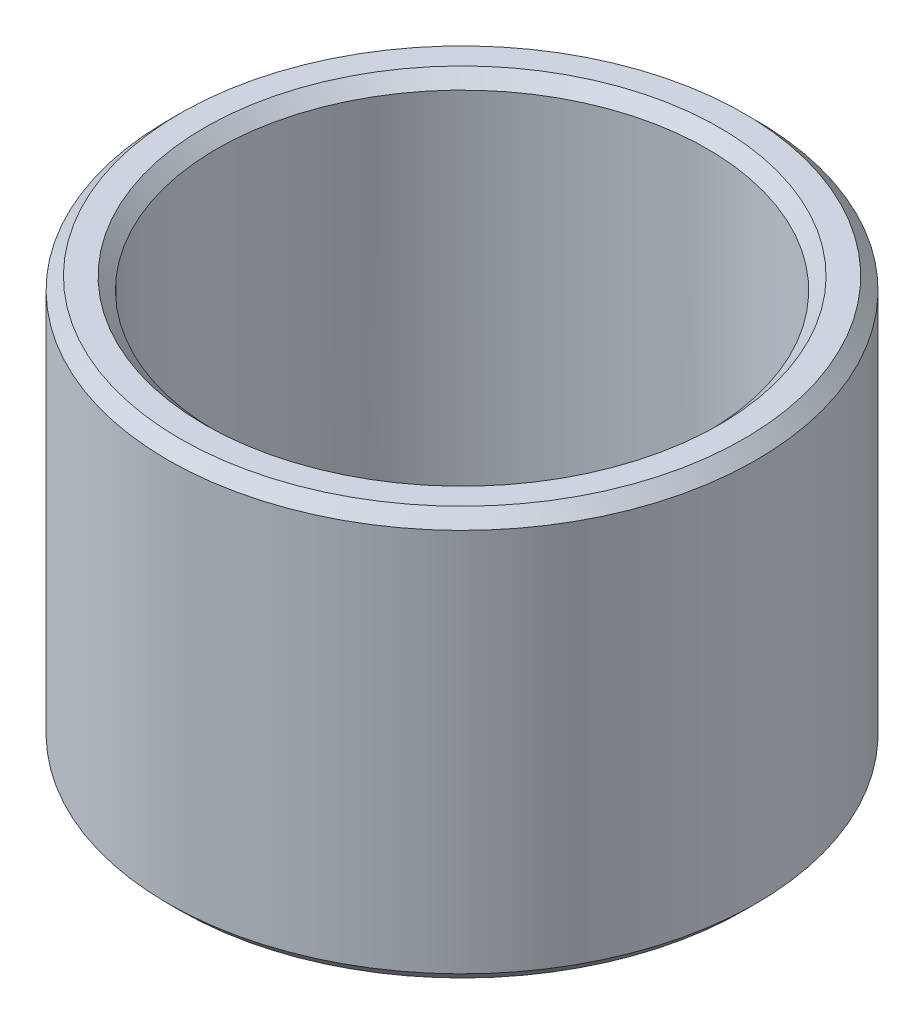
ISO-10303-21;
HEADER;
FILE_DESCRIPTION(('STEP AP214'),'2;1');
FILE_NAME('part.step','',(''),(''),'','','');
FILE_SCHEMA(('AUTOMOTIVE_DESIGN { 1 0 10303 214 1 1 1 1 }'));
ENDSEC;
DATA;
#1=APPLICATION_CONTEXT('core data for automotive mechanical design processes');
#2=APPLICATION_PROTOCOL_DEFINITION('international standard','automotive_design',2000,#1);
#3=PRODUCT_CONTEXT('',#1,'mechanical');
#4=PRODUCT('Part','Part','',(#3));
#5=PRODUCT_RELATED_PRODUCT_CATEGORY('part','',(#4));
#6=PRODUCT_DEFINITION_FORMATION('','',#4);
#7=PRODUCT_DEFINITION_CONTEXT('part definition',#1,'design');
#8=PRODUCT_DEFINITION('design','',#6,#7);
#9=PRODUCT_DEFINITION_SHAPE('','',#8);
#10=(LENGTH_UNIT() NAMED_UNIT(*) SI_UNIT(.MILLI.,.METRE.));
#11=(NAMED_UNIT(*) PLANE_ANGLE_UNIT() SI_UNIT($,.RADIAN.));
#12=(NAMED_UNIT(*) SI_UNIT($,.STERADIAN.) SOLID_ANGLE_UNIT());
#13=UNCERTAINTY_MEASURE_WITH_UNIT(LENGTH_MEASURE(1.E-05),#10,'distance_accuracy_value','');
#14=(GEOMETRIC_REPRESENTATION_CONTEXT(3) GLOBAL_UNCERTAINTY_ASSIGNED_CONTEXT((#13)) GLOBAL_UNIT_ASSIGNED_CONTEXT((#10,
#11,#12)) REPRESENTATION_CONTEXT('',''));
#15=CARTESIAN_POINT('',(0.,0.,0.));
#16=DIRECTION('',(0.,0.,1.));
#17=DIRECTION('',(1.,0.,0.));
#18=AXIS2_PLACEMENT_3D('',#15,#16,#17);
#19=CARTESIAN_POINT('',(0.,0.,0.));
#20=DIRECTION('',(0.,1.,0.));
#21=DIRECTION('',(0.,0.,1.));
#22=AXIS2_PLACEMENT_3D('',#19,#20,#21);
#23=CYLINDRICAL_SURFACE('',#22,30.);
#24=CARTESIAN_POINT('',(0.,1.50000340784923,0.));
#25=DIRECTION('',(0.,-1.,0.));
#26=DIRECTION('',(-4.66199278501E-10,0.,-1.));
#27=AXIS2_PLACEMENT_3D('',#24,#25,#26);
#28=CIRCLE('',#27,30.0000034078484);
#29=CARTESIAN_POINT('',(-1.39859675092686E-08,1.50000340784923,-30.0000034078484));
#30=VERTEX_POINT('',#29);
#31=EDGE_CURVE('E33',#30,#30,#28,.T.);
#32=ORIENTED_EDGE('',*,*,#31,.T.);
#33=EDGE_LOOP('',(#32));
#34=FACE_BOUND('',#33,.T.);
#35=CARTESIAN_POINT('',(0.,48.4999965921608,0.));
#36=DIRECTION('',(0.,1.,0.));
#37=DIRECTION('',(4.66198757716E-10,0.,1.));
#38=AXIS2_PLACEMENT_3D('',#35,#36,#37);
#39=CIRCLE('',#38,30.0000034078385);
#40=CARTESIAN_POINT('',(1.39859039240775E-08,48.4999965921608,30.0000034078385));
#41=VERTEX_POINT('',#40);
#42=EDGE_CURVE('E30',#41,#41,#39,.T.);
#43=ORIENTED_EDGE('',*,*,#42,.T.);
#44=EDGE_LOOP('',(#43));
#45=FACE_BOUND('',#44,.T.);
#46=ADVANCED_FACE('F15',(#34,#45),#23,.F.);
#47=CARTESIAN_POINT('',(0.,3.57824107648751E-06,0.));
#48=DIRECTION('',(0.,-1.,0.));
#49=DIRECTION('',(0.,0.,-1.));
#50=AXIS2_PLACEMENT_3D('',#47,#48,#49);
#51=CONICAL_SURFACE('',#50,31.5000035782403,0.785398276992001);
#52=ORIENTED_EDGE('',*,*,#31,.F.);
#53=EDGE_LOOP('',(#52));
#54=FACE_BOUND('',#53,.T.);
#55=CARTESIAN_POINT('',(0.,0.,0.));
#56=DIRECTION('',(0.,1.,0.));
#57=DIRECTION('',(0.,0.,1.));
#58=AXIS2_PLACEMENT_3D('',#55,#56,#57);
#59=CIRCLE('',#58,31.5000071564822);
#60=CARTESIAN_POINT('',(0.,0.,31.5000071564822));
#61=VERTEX_POINT('',#60);
#62=EDGE_CURVE('E18',#61,#61,#59,.F.);
#63=ORIENTED_EDGE('',*,*,#62,.T.);
#64=EDGE_LOOP('',(#63));
#65=FACE_BOUND('',#64,.T.);
#66=ADVANCED_FACE('F47',(#54,#65),#51,.F.);
#67=CARTESIAN_POINT('',(0.,49.9999964217689,0.));
#68=DIRECTION('',(0.,1.,0.));
#69=DIRECTION('',(0.,0.,1.));
#70=AXIS2_PLACEMENT_3D('',#67,#68,#69);
#71=CONICAL_SURFACE('',#70,31.5000035782302,0.785398276992003);
#72=ORIENTED_EDGE('',*,*,#42,.F.);
#73=EDGE_LOOP('',(#72));
#74=FACE_BOUND('',#73,.T.);
#75=CARTESIAN_POINT('',(0.,50.,0.));
#76=DIRECTION('',(0.,1.,0.));
#77=DIRECTION('',(0.,0.,1.));
#78=AXIS2_PLACEMENT_3D('',#75,#76,#77);
#79=CIRCLE('',#78,31.5000071564622);
#80=CARTESIAN_POINT('',(0.,50.,31.5000071564622));
#81=VERTEX_POINT('',#80);
#82=EDGE_CURVE('E40',#81,#81,#79,.F.);
#83=ORIENTED_EDGE('',*,*,#82,.F.);
#84=EDGE_LOOP('',(#83));
#85=FACE_BOUND('',#84,.T.);
#86=ADVANCED_FACE('F53',(#74,#85),#71,.F.);
#87=CARTESIAN_POINT('',(0.,0.,0.));
#88=DIRECTION('',(0.,1.,0.));
#89=DIRECTION('',(0.,0.,1.));
#90=AXIS2_PLACEMENT_3D('',#87,#88,#89);
#91=PLANE('',#90);
#92=ORIENTED_EDGE('',*,*,#62,.F.);
#93=EDGE_LOOP('',(#92));
#94=FACE_BOUND('',#93,.T.);
#95=CARTESIAN_POINT('',(1.06581410363918E-13,0.,0.));
#96=DIRECTION('',(0.,1.,0.));
#97=DIRECTION('',(0.,0.,1.));
#98=AXIS2_PLACEMENT_3D('',#95,#96,#97);
#99=CIRCLE('',#98,34.4999938155875);
#100=CARTESIAN_POINT('',(1.06581410363918E-13,0.,34.4999938155874));
#101=VERTEX_POINT('',#100);
#102=EDGE_CURVE('E38',#101,#101,#99,.T.);
#103=ORIENTED_EDGE('',*,*,#102,.F.);
#104=EDGE_LOOP('',(#103));
#105=FACE_BOUND('',#104,.T.);
#106=ADVANCED_FACE('F49',(#94,#105),#91,.F.);
#107=CARTESIAN_POINT('',(0.,50.,0.));
#108=DIRECTION('',(0.,1.,0.));
#109=DIRECTION('',(0.,0.,1.));
#110=AXIS2_PLACEMENT_3D('',#107,#108,#109);
#111=PLANE('',#110);
#112=ORIENTED_EDGE('',*,*,#82,.T.);
#113=EDGE_LOOP('',(#112));
#114=FACE_BOUND('',#113,.T.);
#115=CARTESIAN_POINT('',(0.,50.,0.));
#116=DIRECTION('',(0.,1.,0.));
#117=DIRECTION('',(0.,0.,1.));
#118=AXIS2_PLACEMENT_3D('',#115,#116,#117);
#119=CIRCLE('',#118,34.4999938156362);
#120=CARTESIAN_POINT('',(0.,50.,34.4999938156361));
#121=VERTEX_POINT('',#120);
#122=EDGE_CURVE('E27',#121,#121,#119,.F.);
#123=ORIENTED_EDGE('',*,*,#122,.F.);
#124=EDGE_LOOP('',(#123));
#125=FACE_BOUND('',#124,.T.);
#126=ADVANCED_FACE('F52',(#114,#125),#111,.T.);
#127=CARTESIAN_POINT('',(1.06581410363918E-13,1.50000322640578,0.));
#128=DIRECTION('',(0.,1.,0.));
#129=DIRECTION('',(-1.,0.,0.));
#130=AXIS2_PLACEMENT_3D('',#127,#128,#129);
#131=CONICAL_SURFACE('',#130,35.9999967731043,0.785398073768);
#132=CARTESIAN_POINT('',(0.,1.5,0.));
#133=DIRECTION('',(0.,1.,0.));
#134=DIRECTION('',(0.,0.,1.));
#135=AXIS2_PLACEMENT_3D('',#132,#133,#134);
#136=CIRCLE('',#135,36.);
#137=CARTESIAN_POINT('',(0.,1.5,36.));
#138=VERTEX_POINT('',#137);
#139=EDGE_CURVE('E22',#138,#138,#136,.T.);
#140=ORIENTED_EDGE('',*,*,#139,.F.);
#141=EDGE_LOOP('',(#140));
#142=FACE_BOUND('',#141,.T.);
#143=ORIENTED_EDGE('',*,*,#102,.T.);
#144=EDGE_LOOP('',(#143));
#145=FACE_BOUND('',#144,.T.);
#146=ADVANCED_FACE('F57',(#142,#145),#131,.T.);
#147=CARTESIAN_POINT('',(0.,48.4999967733739,0.));
#148=DIRECTION('',(0.,-1.,0.));
#149=DIRECTION('',(0.,0.,-1.));
#150=AXIS2_PLACEMENT_3D('',#147,#148,#149);
#151=CONICAL_SURFACE('',#150,35.9999967733733,0.785398073767996);
#152=CARTESIAN_POINT('',(0.,48.5,0.));
#153=DIRECTION('',(0.,1.,0.));
#154=DIRECTION('',(0.,0.,1.));
#155=AXIS2_PLACEMENT_3D('',#152,#153,#154);
#156=CIRCLE('',#155,36.);
#157=CARTESIAN_POINT('',(0.,48.5,36.));
#158=VERTEX_POINT('',#157);
#159=EDGE_CURVE('E10',#158,#158,#156,.F.);
#160=ORIENTED_EDGE('',*,*,#159,.F.);
#161=EDGE_LOOP('',(#160));
#162=FACE_BOUND('',#161,.T.);
#163=ORIENTED_EDGE('',*,*,#122,.T.);
#164=EDGE_LOOP('',(#163));
#165=FACE_BOUND('',#164,.T.);
#166=ADVANCED_FACE('F59',(#162,#165),#151,.T.);
#167=CARTESIAN_POINT('',(0.,0.,0.));
#168=DIRECTION('',(0.,1.,0.));
#169=DIRECTION('',(0.,0.,1.));
#170=AXIS2_PLACEMENT_3D('',#167,#168,#169);
#171=CYLINDRICAL_SURFACE('',#170,36.);
#172=ORIENTED_EDGE('',*,*,#139,.T.);
#173=EDGE_LOOP('',(#172));
#174=FACE_BOUND('',#173,.T.);
#175=ORIENTED_EDGE('',*,*,#159,.T.);
#176=EDGE_LOOP('',(#175));
#177=FACE_BOUND('',#176,.T.);
#178=ADVANCED_FACE('F67',(#174,#177),#171,.T.);
#179=CLOSED_SHELL('',(#46,#66,#86,#106,#126,#146,#166,#178));
#180=MANIFOLD_SOLID_BREP('B1',#179);
#181=ADVANCED_BREP_SHAPE_REPRESENTATION('',(#18,#180),#14);
#182=SHAPE_DEFINITION_REPRESENTATION(#9,#181);
ENDSEC;
END-ISO-10303-21;
